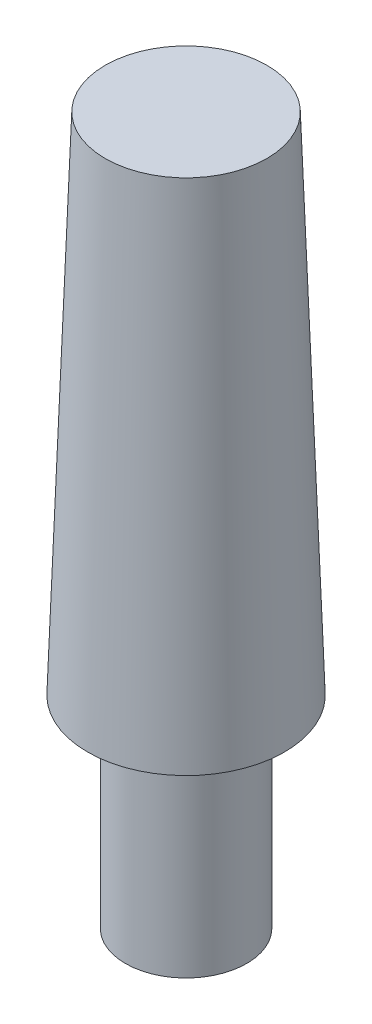
ISO-10303-21;
HEADER;
FILE_DESCRIPTION(('STEP AP214'),'2;1');
FILE_NAME('part.step','',(''),(''),'','','');
FILE_SCHEMA(('AUTOMOTIVE_DESIGN { 1 0 10303 214 1 1 1 1 }'));
ENDSEC;
DATA;
#1=APPLICATION_CONTEXT('core data for automotive mechanical design processes');
#2=APPLICATION_PROTOCOL_DEFINITION('international standard','automotive_design',2000,#1);
#3=PRODUCT_CONTEXT('',#1,'mechanical');
#4=PRODUCT('Part','Part','',(#3));
#5=PRODUCT_RELATED_PRODUCT_CATEGORY('part','',(#4));
#6=PRODUCT_DEFINITION_FORMATION('','',#4);
#7=PRODUCT_DEFINITION_CONTEXT('part definition',#1,'design');
#8=PRODUCT_DEFINITION('design','',#6,#7);
#9=PRODUCT_DEFINITION_SHAPE('','',#8);
#10=(LENGTH_UNIT() NAMED_UNIT(*) SI_UNIT(.MILLI.,.METRE.));
#11=(NAMED_UNIT(*) PLANE_ANGLE_UNIT() SI_UNIT($,.RADIAN.));
#12=(NAMED_UNIT(*) SI_UNIT($,.STERADIAN.) SOLID_ANGLE_UNIT());
#13=UNCERTAINTY_MEASURE_WITH_UNIT(LENGTH_MEASURE(1.E-05),#10,'distance_accuracy_value','');
#14=(GEOMETRIC_REPRESENTATION_CONTEXT(3) GLOBAL_UNCERTAINTY_ASSIGNED_CONTEXT((#13)) GLOBAL_UNIT_ASSIGNED_CONTEXT((#10,
#11,#12)) REPRESENTATION_CONTEXT('',''));
#15=CARTESIAN_POINT('',(0.,0.,0.));
#16=DIRECTION('',(0.,0.,1.));
#17=DIRECTION('',(1.,0.,0.));
#18=AXIS2_PLACEMENT_3D('',#15,#16,#17);
#19=CARTESIAN_POINT('',(0.,0.,0.));
#20=DIRECTION('',(0.,1.,0.));
#21=DIRECTION('',(0.,0.,1.));
#22=AXIS2_PLACEMENT_3D('',#19,#20,#21);
#23=PLANE('',#22);
#24=CARTESIAN_POINT('',(0.,0.,0.));
#25=DIRECTION('',(0.,1.,0.));
#26=DIRECTION('',(0.,0.,1.));
#27=AXIS2_PLACEMENT_3D('',#24,#25,#26);
#28=CIRCLE('',#27,3.);
#29=CARTESIAN_POINT('',(0.,0.,3.));
#30=VERTEX_POINT('',#29);
#31=EDGE_CURVE('E46',#30,#30,#28,.T.);
#32=ORIENTED_EDGE('',*,*,#31,.F.);
#33=EDGE_LOOP('',(#32));
#34=FACE_BOUND('',#33,.T.);
#35=CARTESIAN_POINT('',(0.,0.,0.));
#36=DIRECTION('',(0.,1.,0.));
#37=DIRECTION('',(0.,0.,1.));
#38=AXIS2_PLACEMENT_3D('',#35,#36,#37);
#39=CIRCLE('',#38,1.);
#40=CARTESIAN_POINT('',(0.,0.,1.));
#41=VERTEX_POINT('',#40);
#42=EDGE_CURVE('E52',#41,#41,#39,.T.);
#43=ORIENTED_EDGE('',*,*,#42,.T.);
#44=EDGE_LOOP('',(#43));
#45=FACE_BOUND('',#44,.T.);
#46=ADVANCED_FACE('F37',(#34,#45),#23,.F.);
#47=CARTESIAN_POINT('',(0.,10.,0.));
#48=DIRECTION('',(0.,-1.,0.));
#49=DIRECTION('',(0.,0.,-1.));
#50=AXIS2_PLACEMENT_3D('',#47,#48,#49);
#51=CYLINDRICAL_SURFACE('',#50,3.);
#52=CARTESIAN_POINT('',(0.,10.,0.));
#53=DIRECTION('',(0.,1.,0.));
#54=DIRECTION('',(0.,0.,1.));
#55=AXIS2_PLACEMENT_3D('',#52,#53,#54);
#56=CIRCLE('',#55,3.);
#57=CARTESIAN_POINT('',(0.,10.,3.));
#58=VERTEX_POINT('',#57);
#59=EDGE_CURVE('E10',#58,#58,#56,.T.);
#60=ORIENTED_EDGE('',*,*,#59,.F.);
#61=EDGE_LOOP('',(#60));
#62=FACE_BOUND('',#61,.T.);
#63=ORIENTED_EDGE('',*,*,#31,.T.);
#64=EDGE_LOOP('',(#63));
#65=FACE_BOUND('',#64,.T.);
#66=ADVANCED_FACE('F87',(#62,#65),#51,.T.);
#67=CARTESIAN_POINT('',(0.,10.,0.));
#68=DIRECTION('',(0.,-1.,0.));
#69=DIRECTION('',(0.,0.,-1.));
#70=AXIS2_PLACEMENT_3D('',#67,#68,#69);
#71=CYLINDRICAL_SURFACE('',#70,1.);
#72=CARTESIAN_POINT('',(0.,10.,0.));
#73=DIRECTION('',(0.,1.,0.));
#74=DIRECTION('',(0.,0.,1.));
#75=AXIS2_PLACEMENT_3D('',#72,#73,#74);
#76=CIRCLE('',#75,1.);
#77=CARTESIAN_POINT('',(0.,10.,1.));
#78=VERTEX_POINT('',#77);
#79=EDGE_CURVE('E57',#78,#78,#76,.T.);
#80=ORIENTED_EDGE('',*,*,#79,.T.);
#81=EDGE_LOOP('',(#80));
#82=FACE_BOUND('',#81,.T.);
#83=ORIENTED_EDGE('',*,*,#42,.F.);
#84=EDGE_LOOP('',(#83));
#85=FACE_BOUND('',#84,.T.);
#86=ADVANCED_FACE('F84',(#82,#85),#71,.F.);
#87=CARTESIAN_POINT('',(0.,10.,0.));
#88=DIRECTION('',(0.,1.,0.));
#89=DIRECTION('',(0.,0.,1.));
#90=AXIS2_PLACEMENT_3D('',#87,#88,#89);
#91=PLANE('',#90);
#92=ORIENTED_EDGE('',*,*,#79,.F.);
#93=EDGE_LOOP('',(#92));
#94=FACE_BOUND('',#93,.T.);
#95=ADVANCED_FACE('F76',(#94),#91,.F.);
#96=CARTESIAN_POINT('',(0.,35.,0.));
#97=DIRECTION('',(0.,-1.,0.));
#98=DIRECTION('',(0.,0.,1.));
#99=AXIS2_PLACEMENT_3D('',#96,#97,#98);
#100=CONICAL_SURFACE('',#99,4.,0.0349065850398866);
#101=CARTESIAN_POINT('',(0.,10.,0.));
#102=DIRECTION('',(0.,1.,0.));
#103=DIRECTION('',(0.,0.,1.));
#104=AXIS2_PLACEMENT_3D('',#101,#102,#103);
#105=CIRCLE('',#104,4.87301923729369);
#106=CARTESIAN_POINT('',(0.,10.,4.87301923729369));
#107=VERTEX_POINT('',#106);
#108=EDGE_CURVE('E41',#107,#107,#105,.T.);
#109=ORIENTED_EDGE('',*,*,#108,.T.);
#110=EDGE_LOOP('',(#109));
#111=FACE_BOUND('',#110,.T.);
#112=CARTESIAN_POINT('',(0.,35.,0.));
#113=DIRECTION('',(0.,1.,0.));
#114=DIRECTION('',(0.,0.,1.));
#115=AXIS2_PLACEMENT_3D('',#112,#113,#114);
#116=CIRCLE('',#115,4.);
#117=CARTESIAN_POINT('',(0.,35.,4.));
#118=VERTEX_POINT('',#117);
#119=EDGE_CURVE('E61',#118,#118,#116,.T.);
#120=ORIENTED_EDGE('',*,*,#119,.F.);
#121=EDGE_LOOP('',(#120));
#122=FACE_BOUND('',#121,.T.);
#123=ADVANCED_FACE('F39',(#111,#122),#100,.T.);
#124=ORIENTED_EDGE('',*,*,#59,.T.);
#125=EDGE_LOOP('',(#124));
#126=FACE_BOUND('',#125,.T.);
#127=ORIENTED_EDGE('',*,*,#108,.F.);
#128=EDGE_LOOP('',(#127));
#129=FACE_BOUND('',#128,.T.);
#130=ADVANCED_FACE('F72',(#126,#129),#91,.F.);
#131=CARTESIAN_POINT('',(0.,35.,0.));
#132=DIRECTION('',(0.,1.,0.));
#133=DIRECTION('',(0.,0.,1.));
#134=AXIS2_PLACEMENT_3D('',#131,#132,#133);
#135=PLANE('',#134);
#136=ORIENTED_EDGE('',*,*,#119,.T.);
#137=EDGE_LOOP('',(#136));
#138=FACE_BOUND('',#137,.T.);
#139=ADVANCED_FACE('F74',(#138),#135,.T.);
#140=CLOSED_SHELL('',(#46,#66,#86,#95,#123,#130,#139));
#141=MANIFOLD_SOLID_BREP('B2',#140);
#142=ADVANCED_BREP_SHAPE_REPRESENTATION('',(#18,#141),#14);
#143=SHAPE_DEFINITION_REPRESENTATION(#9,#142);
ENDSEC;
END-ISO-10303-21;
